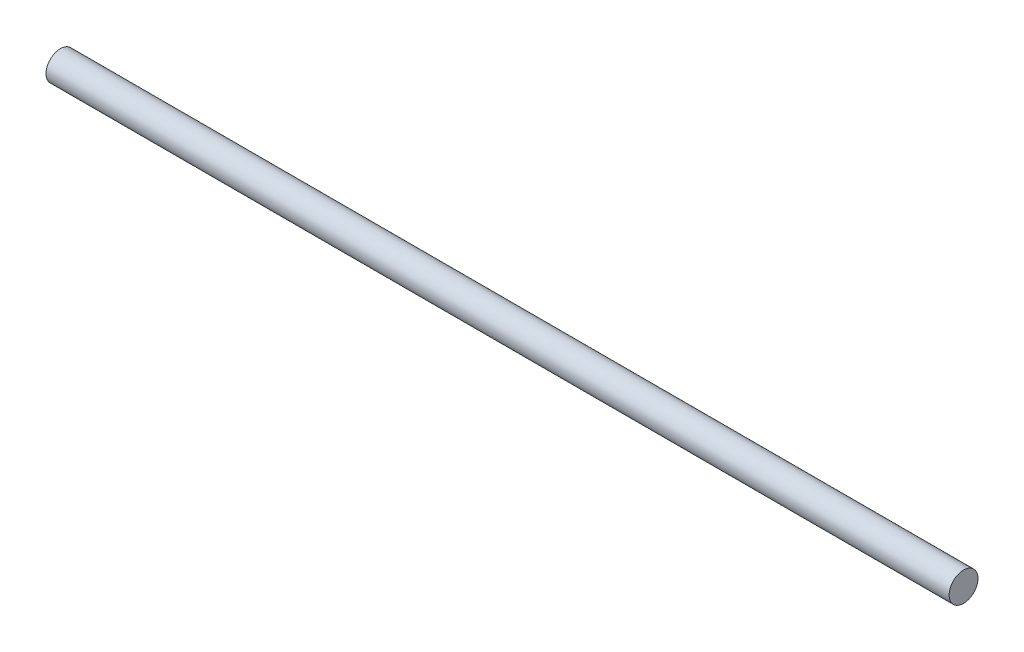
ISO-10303-21;
HEADER;
FILE_DESCRIPTION(('STEP AP214'),'2;1');
FILE_NAME('part.step','',(''),(''),'','','');
FILE_SCHEMA(('AUTOMOTIVE_DESIGN { 1 0 10303 214 1 1 1 1 }'));
ENDSEC;
DATA;
#1=APPLICATION_CONTEXT('core data for automotive mechanical design processes');
#2=APPLICATION_PROTOCOL_DEFINITION('international standard','automotive_design',2000,#1);
#3=PRODUCT_CONTEXT('',#1,'mechanical');
#4=PRODUCT('Part','Part','',(#3));
#5=PRODUCT_RELATED_PRODUCT_CATEGORY('part','',(#4));
#6=PRODUCT_DEFINITION_FORMATION('','',#4);
#7=PRODUCT_DEFINITION_CONTEXT('part definition',#1,'design');
#8=PRODUCT_DEFINITION('design','',#6,#7);
#9=PRODUCT_DEFINITION_SHAPE('','',#8);
#10=(LENGTH_UNIT() NAMED_UNIT(*) SI_UNIT(.MILLI.,.METRE.));
#11=(NAMED_UNIT(*) PLANE_ANGLE_UNIT() SI_UNIT($,.RADIAN.));
#12=(NAMED_UNIT(*) SI_UNIT($,.STERADIAN.) SOLID_ANGLE_UNIT());
#13=UNCERTAINTY_MEASURE_WITH_UNIT(LENGTH_MEASURE(1.E-05),#10,'distance_accuracy_value','');
#14=(GEOMETRIC_REPRESENTATION_CONTEXT(3) GLOBAL_UNCERTAINTY_ASSIGNED_CONTEXT((#13)) GLOBAL_UNIT_ASSIGNED_CONTEXT((#10,
#11,#12)) REPRESENTATION_CONTEXT('',''));
#15=CARTESIAN_POINT('',(0.,0.,0.));
#16=DIRECTION('',(0.,0.,1.));
#17=DIRECTION('',(1.,0.,0.));
#18=AXIS2_PLACEMENT_3D('',#15,#16,#17);
#19=CARTESIAN_POINT('',(62.5,0.,0.));
#20=DIRECTION('',(-1.,0.,0.));
#21=DIRECTION('',(0.,0.,1.));
#22=AXIS2_PLACEMENT_3D('',#19,#20,#21);
#23=CYLINDRICAL_SURFACE('',#22,2.);
#24=CARTESIAN_POINT('',(62.5,0.,0.));
#25=DIRECTION('',(1.,0.,0.));
#26=DIRECTION('',(0.,0.,-1.));
#27=AXIS2_PLACEMENT_3D('',#24,#25,#26);
#28=CIRCLE('',#27,2.);
#29=CARTESIAN_POINT('',(62.5,0.,-2.));
#30=VERTEX_POINT('',#29);
#31=EDGE_CURVE('E10',#30,#30,#28,.T.);
#32=ORIENTED_EDGE('',*,*,#31,.F.);
#33=EDGE_LOOP('',(#32));
#34=FACE_BOUND('',#33,.T.);
#35=CARTESIAN_POINT('',(-62.5,0.,0.));
#36=DIRECTION('',(1.,0.,0.));
#37=DIRECTION('',(0.,0.,-1.));
#38=AXIS2_PLACEMENT_3D('',#35,#36,#37);
#39=CIRCLE('',#38,2.);
#40=CARTESIAN_POINT('',(-62.5,0.,-2.));
#41=VERTEX_POINT('',#40);
#42=EDGE_CURVE('E40',#41,#41,#39,.T.);
#43=ORIENTED_EDGE('',*,*,#42,.T.);
#44=EDGE_LOOP('',(#43));
#45=FACE_BOUND('',#44,.T.);
#46=ADVANCED_FACE('F37',(#34,#45),#23,.T.);
#47=CARTESIAN_POINT('',(62.5,0.,0.));
#48=DIRECTION('',(1.,0.,0.));
#49=DIRECTION('',(0.,0.,-1.));
#50=AXIS2_PLACEMENT_3D('',#47,#48,#49);
#51=PLANE('',#50);
#52=ORIENTED_EDGE('',*,*,#31,.T.);
#53=EDGE_LOOP('',(#52));
#54=FACE_BOUND('',#53,.T.);
#55=ADVANCED_FACE('F52',(#54),#51,.T.);
#56=CARTESIAN_POINT('',(-62.5,0.,0.));
#57=DIRECTION('',(1.,0.,0.));
#58=DIRECTION('',(0.,0.,-1.));
#59=AXIS2_PLACEMENT_3D('',#56,#57,#58);
#60=PLANE('',#59);
#61=ORIENTED_EDGE('',*,*,#42,.F.);
#62=EDGE_LOOP('',(#61));
#63=FACE_BOUND('',#62,.T.);
#64=ADVANCED_FACE('F50',(#63),#60,.F.);
#65=CLOSED_SHELL('',(#46,#55,#64));
#66=MANIFOLD_SOLID_BREP('B2',#65);
#67=ADVANCED_BREP_SHAPE_REPRESENTATION('',(#18,#66),#14);
#68=SHAPE_DEFINITION_REPRESENTATION(#9,#67);
ENDSEC;
END-ISO-10303-21;
